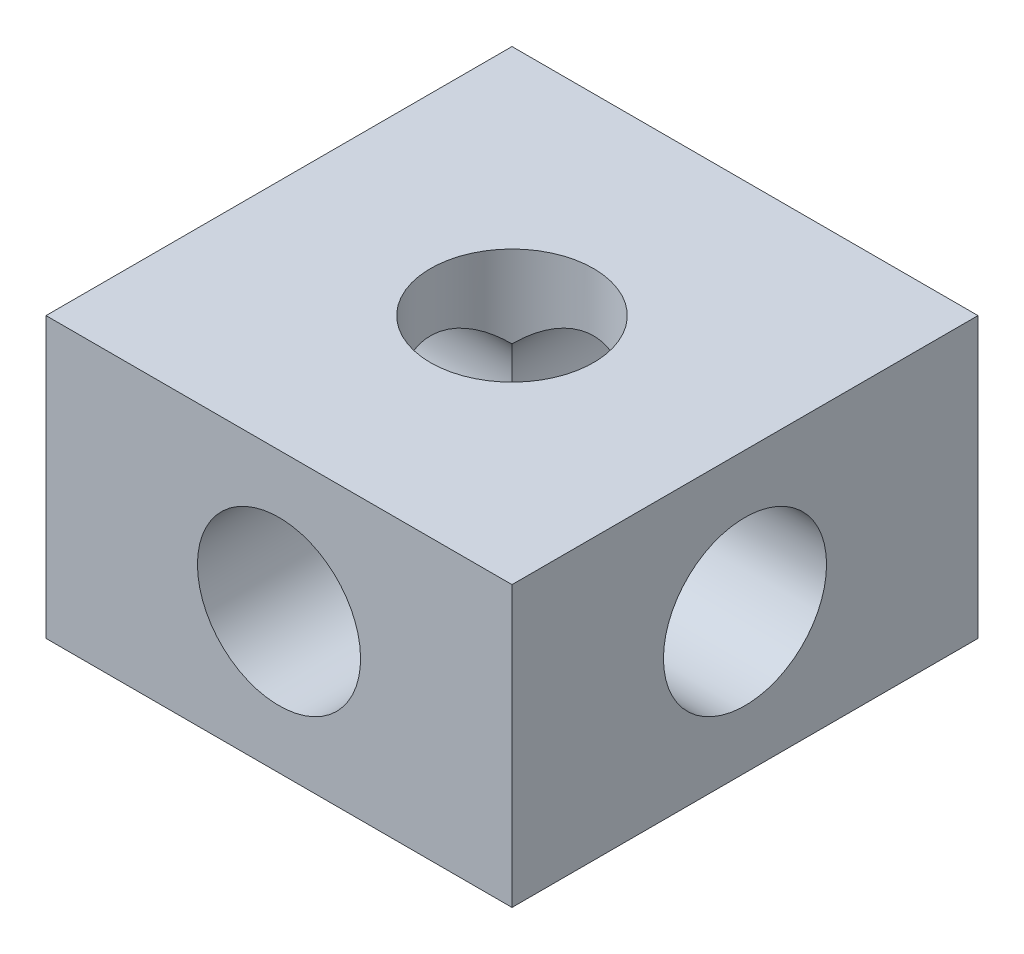
ISO-10303-21;
HEADER;
FILE_DESCRIPTION(('STEP AP214'),'2;1');
FILE_NAME('part.step','',(''),(''),'','','');
FILE_SCHEMA(('AUTOMOTIVE_DESIGN { 1 0 10303 214 1 1 1 1 }'));
ENDSEC;
DATA;
#1=APPLICATION_CONTEXT('core data for automotive mechanical design processes');
#2=APPLICATION_PROTOCOL_DEFINITION('international standard','automotive_design',2000,#1);
#3=PRODUCT_CONTEXT('',#1,'mechanical');
#4=PRODUCT('Part','Part','',(#3));
#5=PRODUCT_RELATED_PRODUCT_CATEGORY('part','',(#4));
#6=PRODUCT_DEFINITION_FORMATION('','',#4);
#7=PRODUCT_DEFINITION_CONTEXT('part definition',#1,'design');
#8=PRODUCT_DEFINITION('design','',#6,#7);
#9=PRODUCT_DEFINITION_SHAPE('','',#8);
#10=(LENGTH_UNIT() NAMED_UNIT(*) SI_UNIT(.MILLI.,.METRE.));
#11=(NAMED_UNIT(*) PLANE_ANGLE_UNIT() SI_UNIT($,.RADIAN.));
#12=(NAMED_UNIT(*) SI_UNIT($,.STERADIAN.) SOLID_ANGLE_UNIT());
#13=UNCERTAINTY_MEASURE_WITH_UNIT(LENGTH_MEASURE(1.E-05),#10,'distance_accuracy_value','');
#14=(GEOMETRIC_REPRESENTATION_CONTEXT(3) GLOBAL_UNCERTAINTY_ASSIGNED_CONTEXT((#13)) GLOBAL_UNIT_ASSIGNED_CONTEXT((#10,
#11,#12)) REPRESENTATION_CONTEXT('',''));
#15=CARTESIAN_POINT('',(0.,0.,0.));
#16=DIRECTION('',(0.,0.,1.));
#17=DIRECTION('',(1.,0.,0.));
#18=AXIS2_PLACEMENT_3D('',#15,#16,#17);
#19=CARTESIAN_POINT('',(0.,3.,0.));
#20=DIRECTION('',(0.,-1.,0.));
#21=DIRECTION('',(0.,0.,-1.));
#22=AXIS2_PLACEMENT_3D('',#19,#20,#21);
#23=CYLINDRICAL_SURFACE('',#22,1.75);
#24=CARTESIAN_POINT('',(0.,0.,0.));
#25=DIRECTION('',(0.707106781186547,-0.707106781186547,0.));
#26=DIRECTION('',(-0.707106781186547,-0.707106781186547,0.));
#27=AXIS2_PLACEMENT_3D('',#24,#25,#26);
#28=ELLIPSE('',#27,2.47487373415292,1.75);
#29=CARTESIAN_POINT('',(1.23743686707646,1.23743686707646,1.23743686707646));
#30=VERTEX_POINT('',#29);
#31=CARTESIAN_POINT('',(1.23743686707646,1.23743686707646,-1.23743686707646));
#32=VERTEX_POINT('',#31);
#33=EDGE_CURVE('E98',#30,#32,#28,.F.);
#34=ORIENTED_EDGE('',*,*,#33,.F.);
#35=CARTESIAN_POINT('',(0.,0.,0.));
#36=DIRECTION('',(0.,-0.707106781186547,0.707106781186547));
#37=DIRECTION('',(0.,-0.707106781186547,-0.707106781186547));
#38=AXIS2_PLACEMENT_3D('',#35,#36,#37);
#39=ELLIPSE('',#38,2.47487373415292,1.75);
#40=CARTESIAN_POINT('',(-1.23743686707646,1.23743686707646,1.23743686707646));
#41=VERTEX_POINT('',#40);
#42=EDGE_CURVE('E104',#41,#30,#39,.F.);
#43=ORIENTED_EDGE('',*,*,#42,.F.);
#44=CARTESIAN_POINT('',(0.,0.,0.));
#45=DIRECTION('',(-0.707106781186547,-0.707106781186547,0.));
#46=DIRECTION('',(0.707106781186547,-0.707106781186547,0.));
#47=AXIS2_PLACEMENT_3D('',#44,#45,#46);
#48=ELLIPSE('',#47,2.47487373415292,1.75);
#49=CARTESIAN_POINT('',(-1.23743686707646,1.23743686707646,-1.23743686707646));
#50=VERTEX_POINT('',#49);
#51=EDGE_CURVE('E57',#50,#41,#48,.F.);
#52=ORIENTED_EDGE('',*,*,#51,.F.);
#53=CARTESIAN_POINT('',(0.,0.,0.));
#54=DIRECTION('',(0.,-0.707106781186547,-0.707106781186547));
#55=DIRECTION('',(0.,-0.707106781186547,0.707106781186547));
#56=AXIS2_PLACEMENT_3D('',#53,#54,#55);
#57=ELLIPSE('',#56,2.47487373415292,1.75);
#58=EDGE_CURVE('E110',#32,#50,#57,.F.);
#59=ORIENTED_EDGE('',*,*,#58,.F.);
#60=EDGE_LOOP('',(#34,#43,#52,#59));
#61=FACE_BOUND('',#60,.T.);
#62=CARTESIAN_POINT('',(0.,3.,0.));
#63=DIRECTION('',(0.,1.,0.));
#64=DIRECTION('',(0.,0.,1.));
#65=AXIS2_PLACEMENT_3D('',#62,#63,#64);
#66=CIRCLE('',#65,1.75);
#67=CARTESIAN_POINT('',(0.,3.,1.75));
#68=VERTEX_POINT('',#67);
#69=EDGE_CURVE('E146',#68,#68,#66,.T.);
#70=ORIENTED_EDGE('',*,*,#69,.T.);
#71=EDGE_LOOP('',(#70));
#72=FACE_BOUND('',#71,.T.);
#73=ADVANCED_FACE('F34',(#61,#72),#23,.F.);
#74=CARTESIAN_POINT('',(0.,3.,0.));
#75=DIRECTION('',(0.,1.,0.));
#76=DIRECTION('',(0.,0.,1.));
#77=AXIS2_PLACEMENT_3D('',#74,#75,#76);
#78=PLANE('',#77);
#79=DIRECTION('',(0.,0.,-1.));
#80=VECTOR('',#79,1.);
#81=CARTESIAN_POINT('',(5.,3.,-5.));
#82=LINE('',#81,#80);
#83=CARTESIAN_POINT('',(5.,3.,5.));
#84=VERTEX_POINT('',#83);
#85=CARTESIAN_POINT('',(5.,3.,-5.));
#86=VERTEX_POINT('',#85);
#87=EDGE_CURVE('E138',#84,#86,#82,.T.);
#88=ORIENTED_EDGE('',*,*,#87,.T.);
#89=DIRECTION('',(-1.,0.,0.));
#90=VECTOR('',#89,1.);
#91=CARTESIAN_POINT('',(-5.,3.,-5.));
#92=LINE('',#91,#90);
#93=CARTESIAN_POINT('',(-5.,3.,-5.));
#94=VERTEX_POINT('',#93);
#95=EDGE_CURVE('E150',#86,#94,#92,.T.);
#96=ORIENTED_EDGE('',*,*,#95,.T.);
#97=DIRECTION('',(0.,0.,1.));
#98=VECTOR('',#97,1.);
#99=CARTESIAN_POINT('',(-5.,3.,-5.));
#100=LINE('',#99,#98);
#101=CARTESIAN_POINT('',(-5.,3.,5.));
#102=VERTEX_POINT('',#101);
#103=EDGE_CURVE('E148',#94,#102,#100,.T.);
#104=ORIENTED_EDGE('',*,*,#103,.T.);
#105=DIRECTION('',(1.,0.,0.));
#106=VECTOR('',#105,1.);
#107=CARTESIAN_POINT('',(-5.,3.,5.));
#108=LINE('',#107,#106);
#109=EDGE_CURVE('E135',#102,#84,#108,.T.);
#110=ORIENTED_EDGE('',*,*,#109,.T.);
#111=EDGE_LOOP('',(#88,#96,#104,#110));
#112=FACE_BOUND('',#111,.T.);
#113=ORIENTED_EDGE('',*,*,#69,.F.);
#114=EDGE_LOOP('',(#113));
#115=FACE_BOUND('',#114,.T.);
#116=ADVANCED_FACE('F214',(#112,#115),#78,.T.);
#117=CARTESIAN_POINT('',(0.,-3.,0.));
#118=DIRECTION('',(0.,1.,0.));
#119=DIRECTION('',(0.,0.,1.));
#120=AXIS2_PLACEMENT_3D('',#117,#118,#119);
#121=PLANE('',#120);
#122=DIRECTION('',(0.,0.,-1.));
#123=VECTOR('',#122,1.);
#124=CARTESIAN_POINT('',(5.,-3.,-5.));
#125=LINE('',#124,#123);
#126=CARTESIAN_POINT('',(5.,-3.,5.));
#127=VERTEX_POINT('',#126);
#128=CARTESIAN_POINT('',(5.,-3.,-5.));
#129=VERTEX_POINT('',#128);
#130=EDGE_CURVE('E143',#127,#129,#125,.T.);
#131=ORIENTED_EDGE('',*,*,#130,.F.);
#132=DIRECTION('',(1.,0.,0.));
#133=VECTOR('',#132,1.);
#134=CARTESIAN_POINT('',(-5.,-3.,5.));
#135=LINE('',#134,#133);
#136=CARTESIAN_POINT('',(-5.,-3.,5.));
#137=VERTEX_POINT('',#136);
#138=EDGE_CURVE('E136',#137,#127,#135,.T.);
#139=ORIENTED_EDGE('',*,*,#138,.F.);
#140=DIRECTION('',(0.,0.,1.));
#141=VECTOR('',#140,1.);
#142=CARTESIAN_POINT('',(-5.,-3.,-5.));
#143=LINE('',#142,#141);
#144=CARTESIAN_POINT('',(-5.,-3.,-5.));
#145=VERTEX_POINT('',#144);
#146=EDGE_CURVE('E139',#145,#137,#143,.T.);
#147=ORIENTED_EDGE('',*,*,#146,.F.);
#148=DIRECTION('',(-1.,0.,0.));
#149=VECTOR('',#148,1.);
#150=CARTESIAN_POINT('',(-5.,-3.,-5.));
#151=LINE('',#150,#149);
#152=EDGE_CURVE('E141',#129,#145,#151,.T.);
#153=ORIENTED_EDGE('',*,*,#152,.F.);
#154=EDGE_LOOP('',(#131,#139,#147,#153));
#155=FACE_BOUND('',#154,.T.);
#156=CARTESIAN_POINT('',(0.,-3.,0.));
#157=DIRECTION('',(0.,1.,0.));
#158=DIRECTION('',(0.,0.,1.));
#159=AXIS2_PLACEMENT_3D('',#156,#157,#158);
#160=CIRCLE('',#159,1.75);
#161=CARTESIAN_POINT('',(0.,-3.,1.75));
#162=VERTEX_POINT('',#161);
#163=EDGE_CURVE('E154',#162,#162,#160,.T.);
#164=ORIENTED_EDGE('',*,*,#163,.T.);
#165=EDGE_LOOP('',(#164));
#166=FACE_BOUND('',#165,.T.);
#167=ADVANCED_FACE('F208',(#155,#166),#121,.F.);
#168=CARTESIAN_POINT('',(5.,3.,-5.));
#169=DIRECTION('',(-1.,0.,0.));
#170=DIRECTION('',(0.,0.,1.));
#171=AXIS2_PLACEMENT_3D('',#168,#169,#170);
#172=PLANE('',#171);
#173=CARTESIAN_POINT('',(5.,0.,0.));
#174=DIRECTION('',(-1.,0.,0.));
#175=DIRECTION('',(0.,0.,1.));
#176=AXIS2_PLACEMENT_3D('',#173,#174,#175);
#177=CIRCLE('',#176,1.75);
#178=CARTESIAN_POINT('',(5.,0.,1.75));
#179=VERTEX_POINT('',#178);
#180=EDGE_CURVE('E165',#179,#179,#177,.T.);
#181=ORIENTED_EDGE('',*,*,#180,.T.);
#182=EDGE_LOOP('',(#181));
#183=FACE_BOUND('',#182,.T.);
#184=ORIENTED_EDGE('',*,*,#130,.T.);
#185=DIRECTION('',(0.,-1.,0.));
#186=VECTOR('',#185,1.);
#187=CARTESIAN_POINT('',(5.,3.,-5.));
#188=LINE('',#187,#186);
#189=EDGE_CURVE('E123',#86,#129,#188,.T.);
#190=ORIENTED_EDGE('',*,*,#189,.F.);
#191=ORIENTED_EDGE('',*,*,#87,.F.);
#192=DIRECTION('',(0.,-1.,0.));
#193=VECTOR('',#192,1.);
#194=CARTESIAN_POINT('',(5.,3.,5.));
#195=LINE('',#194,#193);
#196=EDGE_CURVE('E132',#84,#127,#195,.T.);
#197=ORIENTED_EDGE('',*,*,#196,.T.);
#198=EDGE_LOOP('',(#184,#190,#191,#197));
#199=FACE_BOUND('',#198,.T.);
#200=ADVANCED_FACE('F36',(#183,#199),#172,.F.);
#201=CARTESIAN_POINT('',(-5.,3.,-5.));
#202=DIRECTION('',(0.,0.,1.));
#203=DIRECTION('',(1.,0.,0.));
#204=AXIS2_PLACEMENT_3D('',#201,#202,#203);
#205=PLANE('',#204);
#206=CARTESIAN_POINT('',(0.,0.,-5.));
#207=DIRECTION('',(0.,0.,1.));
#208=DIRECTION('',(1.,0.,0.));
#209=AXIS2_PLACEMENT_3D('',#206,#207,#208);
#210=CIRCLE('',#209,1.75);
#211=CARTESIAN_POINT('',(1.75,0.,-5.));
#212=VERTEX_POINT('',#211);
#213=EDGE_CURVE('E157',#212,#212,#210,.T.);
#214=ORIENTED_EDGE('',*,*,#213,.T.);
#215=EDGE_LOOP('',(#214));
#216=FACE_BOUND('',#215,.T.);
#217=ORIENTED_EDGE('',*,*,#152,.T.);
#218=DIRECTION('',(0.,-1.,0.));
#219=VECTOR('',#218,1.);
#220=CARTESIAN_POINT('',(-5.,3.,-5.));
#221=LINE('',#220,#219);
#222=EDGE_CURVE('E126',#94,#145,#221,.T.);
#223=ORIENTED_EDGE('',*,*,#222,.F.);
#224=ORIENTED_EDGE('',*,*,#95,.F.);
#225=ORIENTED_EDGE('',*,*,#189,.T.);
#226=EDGE_LOOP('',(#217,#223,#224,#225));
#227=FACE_BOUND('',#226,.T.);
#228=ADVANCED_FACE('F196',(#216,#227),#205,.F.);
#229=CARTESIAN_POINT('',(-5.,3.,-5.));
#230=DIRECTION('',(1.,0.,0.));
#231=DIRECTION('',(0.,0.,-1.));
#232=AXIS2_PLACEMENT_3D('',#229,#230,#231);
#233=PLANE('',#232);
#234=CARTESIAN_POINT('',(-5.,0.,0.));
#235=DIRECTION('',(1.,0.,0.));
#236=DIRECTION('',(0.,0.,-1.));
#237=AXIS2_PLACEMENT_3D('',#234,#235,#236);
#238=CIRCLE('',#237,1.75);
#239=CARTESIAN_POINT('',(-5.,0.,-1.75));
#240=VERTEX_POINT('',#239);
#241=EDGE_CURVE('E168',#240,#240,#238,.T.);
#242=ORIENTED_EDGE('',*,*,#241,.T.);
#243=EDGE_LOOP('',(#242));
#244=FACE_BOUND('',#243,.T.);
#245=ORIENTED_EDGE('',*,*,#146,.T.);
#246=DIRECTION('',(0.,-1.,0.));
#247=VECTOR('',#246,1.);
#248=CARTESIAN_POINT('',(-5.,3.,5.));
#249=LINE('',#248,#247);
#250=EDGE_CURVE('E129',#102,#137,#249,.T.);
#251=ORIENTED_EDGE('',*,*,#250,.F.);
#252=ORIENTED_EDGE('',*,*,#103,.F.);
#253=ORIENTED_EDGE('',*,*,#222,.T.);
#254=EDGE_LOOP('',(#245,#251,#252,#253));
#255=FACE_BOUND('',#254,.T.);
#256=ADVANCED_FACE('F192',(#244,#255),#233,.F.);
#257=CARTESIAN_POINT('',(-5.,3.,5.));
#258=DIRECTION('',(0.,0.,-1.));
#259=DIRECTION('',(-1.,0.,0.));
#260=AXIS2_PLACEMENT_3D('',#257,#258,#259);
#261=PLANE('',#260);
#262=CARTESIAN_POINT('',(0.,0.,5.));
#263=DIRECTION('',(0.,0.,-1.));
#264=DIRECTION('',(-1.,0.,0.));
#265=AXIS2_PLACEMENT_3D('',#262,#263,#264);
#266=CIRCLE('',#265,1.75);
#267=CARTESIAN_POINT('',(-1.75,0.,5.));
#268=VERTEX_POINT('',#267);
#269=EDGE_CURVE('E162',#268,#268,#266,.T.);
#270=ORIENTED_EDGE('',*,*,#269,.T.);
#271=EDGE_LOOP('',(#270));
#272=FACE_BOUND('',#271,.T.);
#273=ORIENTED_EDGE('',*,*,#138,.T.);
#274=ORIENTED_EDGE('',*,*,#196,.F.);
#275=ORIENTED_EDGE('',*,*,#109,.F.);
#276=ORIENTED_EDGE('',*,*,#250,.T.);
#277=EDGE_LOOP('',(#273,#274,#275,#276));
#278=FACE_BOUND('',#277,.T.);
#279=ADVANCED_FACE('F195',(#272,#278),#261,.F.);
#280=CARTESIAN_POINT('',(0.,0.,0.));
#281=DIRECTION('',(0.707106781186547,-0.707106781186547,0.));
#282=DIRECTION('',(-0.707106781186547,-0.707106781186547,0.));
#283=AXIS2_PLACEMENT_3D('',#280,#281,#282);
#284=ELLIPSE('',#283,2.47487373415292,1.75);
#285=CARTESIAN_POINT('',(-1.23743686707646,-1.23743686707646,1.23743686707646));
#286=VERTEX_POINT('',#285);
#287=CARTESIAN_POINT('',(-1.23743686707646,-1.23743686707646,-1.23743686707646));
#288=VERTEX_POINT('',#287);
#289=EDGE_CURVE('E175',#286,#288,#284,.T.);
#290=ORIENTED_EDGE('',*,*,#289,.F.);
#291=CARTESIAN_POINT('',(0.,0.,0.));
#292=DIRECTION('',(0.,-0.707106781186547,-0.707106781186547));
#293=DIRECTION('',(0.,-0.707106781186547,0.707106781186547));
#294=AXIS2_PLACEMENT_3D('',#291,#292,#293);
#295=ELLIPSE('',#294,2.47487373415292,1.75);
#296=CARTESIAN_POINT('',(1.23743686707646,-1.23743686707646,1.23743686707646));
#297=VERTEX_POINT('',#296);
#298=EDGE_CURVE('E118',#297,#286,#295,.T.);
#299=ORIENTED_EDGE('',*,*,#298,.F.);
#300=CARTESIAN_POINT('',(0.,0.,0.));
#301=DIRECTION('',(-0.707106781186547,-0.707106781186547,0.));
#302=DIRECTION('',(0.707106781186547,-0.707106781186547,0.));
#303=AXIS2_PLACEMENT_3D('',#300,#301,#302);
#304=ELLIPSE('',#303,2.47487373415292,1.75);
#305=CARTESIAN_POINT('',(1.23743686707646,-1.23743686707646,-1.23743686707646));
#306=VERTEX_POINT('',#305);
#307=EDGE_CURVE('E49',#306,#297,#304,.T.);
#308=ORIENTED_EDGE('',*,*,#307,.F.);
#309=CARTESIAN_POINT('',(0.,0.,0.));
#310=DIRECTION('',(0.,-0.707106781186547,0.707106781186547));
#311=DIRECTION('',(0.,-0.707106781186547,-0.707106781186547));
#312=AXIS2_PLACEMENT_3D('',#309,#310,#311);
#313=ELLIPSE('',#312,2.47487373415292,1.75);
#314=EDGE_CURVE('E115',#288,#306,#313,.T.);
#315=ORIENTED_EDGE('',*,*,#314,.F.);
#316=EDGE_LOOP('',(#290,#299,#308,#315));
#317=FACE_BOUND('',#316,.T.);
#318=ORIENTED_EDGE('',*,*,#163,.F.);
#319=EDGE_LOOP('',(#318));
#320=FACE_BOUND('',#319,.T.);
#321=ADVANCED_FACE('F184',(#317,#320),#23,.F.);
#322=CARTESIAN_POINT('',(0.,0.,-8.5));
#323=DIRECTION('',(0.,0.,1.));
#324=DIRECTION('',(1.,0.,0.));
#325=AXIS2_PLACEMENT_3D('',#322,#323,#324);
#326=CYLINDRICAL_SURFACE('',#325,1.75);
#327=ORIENTED_EDGE('',*,*,#314,.T.);
#328=CARTESIAN_POINT('',(0.,0.,0.));
#329=DIRECTION('',(0.707106781186547,0.,0.707106781186547));
#330=DIRECTION('',(-0.707106781186547,0.,0.707106781186547));
#331=AXIS2_PLACEMENT_3D('',#328,#329,#330);
#332=ELLIPSE('',#331,2.47487373415292,1.75);
#333=EDGE_CURVE('E111',#306,#32,#332,.T.);
#334=ORIENTED_EDGE('',*,*,#333,.T.);
#335=ORIENTED_EDGE('',*,*,#58,.T.);
#336=CARTESIAN_POINT('',(0.,0.,0.));
#337=DIRECTION('',(-0.707106781186547,0.,0.707106781186547));
#338=DIRECTION('',(0.707106781186547,0.,0.707106781186547));
#339=AXIS2_PLACEMENT_3D('',#336,#337,#338);
#340=ELLIPSE('',#339,2.47487373415292,1.75);
#341=EDGE_CURVE('E171',#50,#288,#340,.T.);
#342=ORIENTED_EDGE('',*,*,#341,.T.);
#343=EDGE_LOOP('',(#327,#334,#335,#342));
#344=FACE_BOUND('',#343,.T.);
#345=ORIENTED_EDGE('',*,*,#213,.F.);
#346=EDGE_LOOP('',(#345));
#347=FACE_BOUND('',#346,.T.);
#348=ADVANCED_FACE('F179',(#344,#347),#326,.F.);
#349=ORIENTED_EDGE('',*,*,#298,.T.);
#350=CARTESIAN_POINT('',(0.,0.,0.));
#351=DIRECTION('',(0.707106781186547,0.,0.707106781186547));
#352=DIRECTION('',(-0.707106781186547,0.,0.707106781186547));
#353=AXIS2_PLACEMENT_3D('',#350,#351,#352);
#354=ELLIPSE('',#353,2.47487373415292,1.75);
#355=EDGE_CURVE('E11',#286,#41,#354,.F.);
#356=ORIENTED_EDGE('',*,*,#355,.T.);
#357=ORIENTED_EDGE('',*,*,#42,.T.);
#358=CARTESIAN_POINT('',(0.,0.,0.));
#359=DIRECTION('',(-0.707106781186547,0.,0.707106781186547));
#360=DIRECTION('',(0.707106781186547,0.,0.707106781186547));
#361=AXIS2_PLACEMENT_3D('',#358,#359,#360);
#362=ELLIPSE('',#361,2.47487373415292,1.75);
#363=EDGE_CURVE('E42',#30,#297,#362,.F.);
#364=ORIENTED_EDGE('',*,*,#363,.T.);
#365=EDGE_LOOP('',(#349,#356,#357,#364));
#366=FACE_BOUND('',#365,.T.);
#367=ORIENTED_EDGE('',*,*,#269,.F.);
#368=EDGE_LOOP('',(#367));
#369=FACE_BOUND('',#368,.T.);
#370=ADVANCED_FACE('F113',(#366,#369),#326,.F.);
#371=CARTESIAN_POINT('',(-8.5,0.,0.));
#372=DIRECTION('',(1.,0.,0.));
#373=DIRECTION('',(0.,0.,-1.));
#374=AXIS2_PLACEMENT_3D('',#371,#372,#373);
#375=CYLINDRICAL_SURFACE('',#374,1.75);
#376=ORIENTED_EDGE('',*,*,#307,.T.);
#377=ORIENTED_EDGE('',*,*,#363,.F.);
#378=ORIENTED_EDGE('',*,*,#33,.T.);
#379=ORIENTED_EDGE('',*,*,#333,.F.);
#380=EDGE_LOOP('',(#376,#377,#378,#379));
#381=FACE_BOUND('',#380,.T.);
#382=ORIENTED_EDGE('',*,*,#180,.F.);
#383=EDGE_LOOP('',(#382));
#384=FACE_BOUND('',#383,.T.);
#385=ADVANCED_FACE('F96',(#381,#384),#375,.F.);
#386=ORIENTED_EDGE('',*,*,#51,.T.);
#387=ORIENTED_EDGE('',*,*,#355,.F.);
#388=ORIENTED_EDGE('',*,*,#289,.T.);
#389=ORIENTED_EDGE('',*,*,#341,.F.);
#390=EDGE_LOOP('',(#386,#387,#388,#389));
#391=FACE_BOUND('',#390,.T.);
#392=ORIENTED_EDGE('',*,*,#241,.F.);
#393=EDGE_LOOP('',(#392));
#394=FACE_BOUND('',#393,.T.);
#395=ADVANCED_FACE('F186',(#391,#394),#375,.F.);
#396=CLOSED_SHELL('',(#73,#116,#167,#200,#228,#256,#279,#321,#348,#370,#385,#395));
#397=MANIFOLD_SOLID_BREP('B2',#396);
#398=ADVANCED_BREP_SHAPE_REPRESENTATION('',(#18,#397),#14);
#399=SHAPE_DEFINITION_REPRESENTATION(#9,#398);
ENDSEC;
END-ISO-10303-21;
